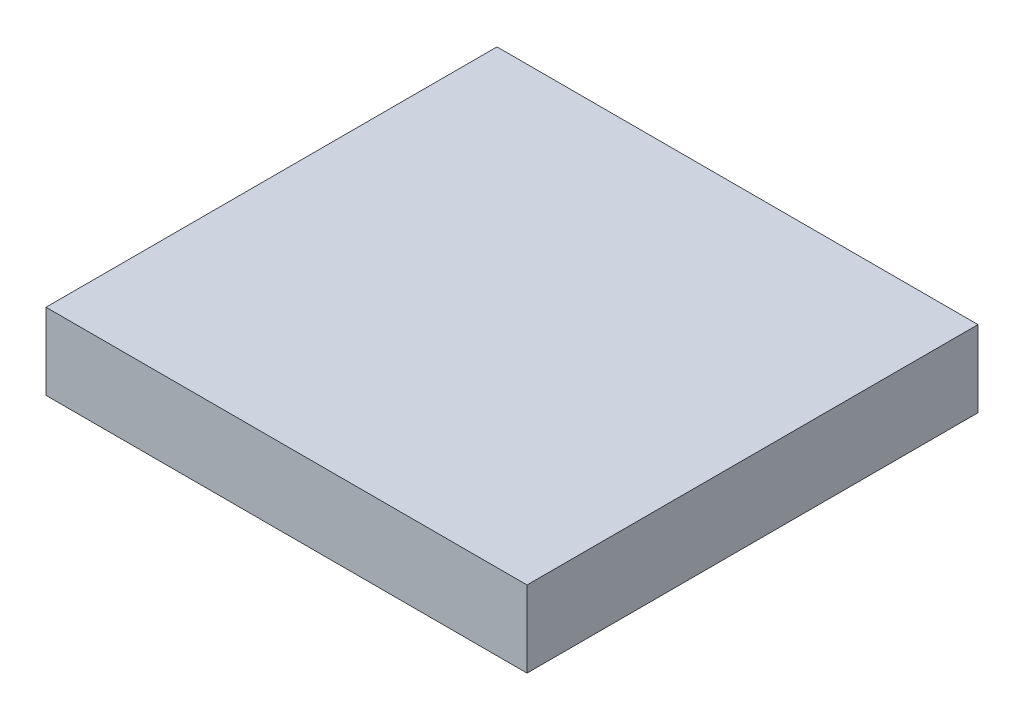
ISO-10303-21;
HEADER;
FILE_DESCRIPTION(('STEP AP214'),'2;1');
FILE_NAME('part.step','',(''),(''),'','','');
FILE_SCHEMA(('AUTOMOTIVE_DESIGN { 1 0 10303 214 1 1 1 1 }'));
ENDSEC;
DATA;
#1=APPLICATION_CONTEXT('core data for automotive mechanical design processes');
#2=APPLICATION_PROTOCOL_DEFINITION('international standard','automotive_design',2000,#1);
#3=PRODUCT_CONTEXT('',#1,'mechanical');
#4=PRODUCT('Part','Part','',(#3));
#5=PRODUCT_RELATED_PRODUCT_CATEGORY('part','',(#4));
#6=PRODUCT_DEFINITION_FORMATION('','',#4);
#7=PRODUCT_DEFINITION_CONTEXT('part definition',#1,'design');
#8=PRODUCT_DEFINITION('design','',#6,#7);
#9=PRODUCT_DEFINITION_SHAPE('','',#8);
#10=(LENGTH_UNIT() NAMED_UNIT(*) SI_UNIT(.MILLI.,.METRE.));
#11=(NAMED_UNIT(*) PLANE_ANGLE_UNIT() SI_UNIT($,.RADIAN.));
#12=(NAMED_UNIT(*) SI_UNIT($,.STERADIAN.) SOLID_ANGLE_UNIT());
#13=UNCERTAINTY_MEASURE_WITH_UNIT(LENGTH_MEASURE(1.E-05),#10,'distance_accuracy_value','');
#14=(GEOMETRIC_REPRESENTATION_CONTEXT(3) GLOBAL_UNCERTAINTY_ASSIGNED_CONTEXT((#13)) GLOBAL_UNIT_ASSIGNED_CONTEXT((#10,
#11,#12)) REPRESENTATION_CONTEXT('',''));
#15=CARTESIAN_POINT('',(0.,0.,0.));
#16=DIRECTION('',(0.,0.,1.));
#17=DIRECTION('',(1.,0.,0.));
#18=AXIS2_PLACEMENT_3D('',#15,#16,#17);
#19=CARTESIAN_POINT('',(0.,15.24,0.));
#20=DIRECTION('',(1.,0.,0.));
#21=DIRECTION('',(0.,0.,-1.));
#22=AXIS2_PLACEMENT_3D('',#19,#20,#21);
#23=PLANE('',#22);
#24=DIRECTION('',(0.,0.,1.));
#25=VECTOR('',#24,1.);
#26=CARTESIAN_POINT('',(0.,0.,0.));
#27=LINE('',#26,#25);
#28=CARTESIAN_POINT('',(0.,0.,-90.));
#29=VERTEX_POINT('',#28);
#30=CARTESIAN_POINT('',(0.,0.,0.));
#31=VERTEX_POINT('',#30);
#32=EDGE_CURVE('E104',#29,#31,#27,.T.);
#33=ORIENTED_EDGE('',*,*,#32,.T.);
#34=DIRECTION('',(0.,-1.,0.));
#35=VECTOR('',#34,1.);
#36=CARTESIAN_POINT('',(0.,15.24,0.));
#37=LINE('',#36,#35);
#38=CARTESIAN_POINT('',(0.,15.24,0.));
#39=VERTEX_POINT('',#38);
#40=EDGE_CURVE('E11',#39,#31,#37,.T.);
#41=ORIENTED_EDGE('',*,*,#40,.F.);
#42=DIRECTION('',(0.,0.,1.));
#43=VECTOR('',#42,1.);
#44=CARTESIAN_POINT('',(0.,15.24,0.));
#45=LINE('',#44,#43);
#46=CARTESIAN_POINT('',(0.,15.24,-90.));
#47=VERTEX_POINT('',#46);
#48=EDGE_CURVE('E92',#47,#39,#45,.T.);
#49=ORIENTED_EDGE('',*,*,#48,.F.);
#50=DIRECTION('',(0.,-1.,0.));
#51=VECTOR('',#50,1.);
#52=CARTESIAN_POINT('',(0.,15.24,-90.));
#53=LINE('',#52,#51);
#54=EDGE_CURVE('E100',#47,#29,#53,.T.);
#55=ORIENTED_EDGE('',*,*,#54,.T.);
#56=EDGE_LOOP('',(#33,#41,#49,#55));
#57=FACE_BOUND('',#56,.T.);
#58=ADVANCED_FACE('F41',(#57),#23,.F.);
#59=CARTESIAN_POINT('',(0.,15.24,0.));
#60=DIRECTION('',(0.,0.,-1.));
#61=DIRECTION('',(-1.,0.,0.));
#62=AXIS2_PLACEMENT_3D('',#59,#60,#61);
#63=PLANE('',#62);
#64=DIRECTION('',(1.,0.,0.));
#65=VECTOR('',#64,1.);
#66=CARTESIAN_POINT('',(0.,0.,0.));
#67=LINE('',#66,#65);
#68=CARTESIAN_POINT('',(96.,0.,0.));
#69=VERTEX_POINT('',#68);
#70=EDGE_CURVE('E96',#31,#69,#67,.T.);
#71=ORIENTED_EDGE('',*,*,#70,.T.);
#72=DIRECTION('',(0.,-1.,0.));
#73=VECTOR('',#72,1.);
#74=CARTESIAN_POINT('',(96.,15.24,0.));
#75=LINE('',#74,#73);
#76=CARTESIAN_POINT('',(96.,15.24,0.));
#77=VERTEX_POINT('',#76);
#78=EDGE_CURVE('E49',#77,#69,#75,.T.);
#79=ORIENTED_EDGE('',*,*,#78,.F.);
#80=DIRECTION('',(1.,0.,0.));
#81=VECTOR('',#80,1.);
#82=CARTESIAN_POINT('',(0.,15.24,0.));
#83=LINE('',#82,#81);
#84=EDGE_CURVE('E87',#39,#77,#83,.T.);
#85=ORIENTED_EDGE('',*,*,#84,.F.);
#86=ORIENTED_EDGE('',*,*,#40,.T.);
#87=EDGE_LOOP('',(#71,#79,#85,#86));
#88=FACE_BOUND('',#87,.T.);
#89=ADVANCED_FACE('F95',(#88),#63,.F.);
#90=CARTESIAN_POINT('',(96.,15.24,0.));
#91=DIRECTION('',(-1.,0.,0.));
#92=DIRECTION('',(0.,0.,1.));
#93=AXIS2_PLACEMENT_3D('',#90,#91,#92);
#94=PLANE('',#93);
#95=DIRECTION('',(0.,0.,-1.));
#96=VECTOR('',#95,1.);
#97=CARTESIAN_POINT('',(96.,0.,0.));
#98=LINE('',#97,#96);
#99=CARTESIAN_POINT('',(96.,0.,-90.));
#100=VERTEX_POINT('',#99);
#101=EDGE_CURVE('E74',#69,#100,#98,.T.);
#102=ORIENTED_EDGE('',*,*,#101,.T.);
#103=DIRECTION('',(0.,-1.,0.));
#104=VECTOR('',#103,1.);
#105=CARTESIAN_POINT('',(96.,15.24,-90.));
#106=LINE('',#105,#104);
#107=CARTESIAN_POINT('',(96.,15.24,-90.));
#108=VERTEX_POINT('',#107);
#109=EDGE_CURVE('E97',#108,#100,#106,.T.);
#110=ORIENTED_EDGE('',*,*,#109,.F.);
#111=DIRECTION('',(0.,0.,-1.));
#112=VECTOR('',#111,1.);
#113=CARTESIAN_POINT('',(96.,15.24,0.));
#114=LINE('',#113,#112);
#115=EDGE_CURVE('E90',#77,#108,#114,.T.);
#116=ORIENTED_EDGE('',*,*,#115,.F.);
#117=ORIENTED_EDGE('',*,*,#78,.T.);
#118=EDGE_LOOP('',(#102,#110,#116,#117));
#119=FACE_BOUND('',#118,.T.);
#120=ADVANCED_FACE('F98',(#119),#94,.F.);
#121=CARTESIAN_POINT('',(0.,15.24,-90.));
#122=DIRECTION('',(0.,0.,1.));
#123=DIRECTION('',(1.,0.,0.));
#124=AXIS2_PLACEMENT_3D('',#121,#122,#123);
#125=PLANE('',#124);
#126=DIRECTION('',(-1.,0.,0.));
#127=VECTOR('',#126,1.);
#128=CARTESIAN_POINT('',(0.,0.,-90.));
#129=LINE('',#128,#127);
#130=EDGE_CURVE('E80',#100,#29,#129,.T.);
#131=ORIENTED_EDGE('',*,*,#130,.T.);
#132=ORIENTED_EDGE('',*,*,#54,.F.);
#133=DIRECTION('',(-1.,0.,0.));
#134=VECTOR('',#133,1.);
#135=CARTESIAN_POINT('',(0.,15.24,-90.));
#136=LINE('',#135,#134);
#137=EDGE_CURVE('E57',#108,#47,#136,.T.);
#138=ORIENTED_EDGE('',*,*,#137,.F.);
#139=ORIENTED_EDGE('',*,*,#109,.T.);
#140=EDGE_LOOP('',(#131,#132,#138,#139));
#141=FACE_BOUND('',#140,.T.);
#142=ADVANCED_FACE('F111',(#141),#125,.F.);
#143=CARTESIAN_POINT('',(0.,15.24,0.));
#144=DIRECTION('',(0.,-1.,0.));
#145=DIRECTION('',(0.,0.,-1.));
#146=AXIS2_PLACEMENT_3D('',#143,#144,#145);
#147=PLANE('',#146);
#148=ORIENTED_EDGE('',*,*,#48,.T.);
#149=ORIENTED_EDGE('',*,*,#84,.T.);
#150=ORIENTED_EDGE('',*,*,#115,.T.);
#151=ORIENTED_EDGE('',*,*,#137,.T.);
#152=EDGE_LOOP('',(#148,#149,#150,#151));
#153=FACE_BOUND('',#152,.T.);
#154=ADVANCED_FACE('F88',(#153),#147,.F.);
#155=CARTESIAN_POINT('',(0.,0.,0.));
#156=DIRECTION('',(0.,-1.,0.));
#157=DIRECTION('',(0.,0.,-1.));
#158=AXIS2_PLACEMENT_3D('',#155,#156,#157);
#159=PLANE('',#158);
#160=ORIENTED_EDGE('',*,*,#32,.F.);
#161=ORIENTED_EDGE('',*,*,#130,.F.);
#162=ORIENTED_EDGE('',*,*,#101,.F.);
#163=ORIENTED_EDGE('',*,*,#70,.F.);
#164=EDGE_LOOP('',(#160,#161,#162,#163));
#165=FACE_BOUND('',#164,.T.);
#166=ADVANCED_FACE('F114',(#165),#159,.T.);
#167=CLOSED_SHELL('',(#58,#89,#120,#142,#154,#166));
#168=MANIFOLD_SOLID_BREP('B2',#167);
#169=ADVANCED_BREP_SHAPE_REPRESENTATION('',(#18,#168),#14);
#170=SHAPE_DEFINITION_REPRESENTATION(#9,#169);
ENDSEC;
END-ISO-10303-21;
